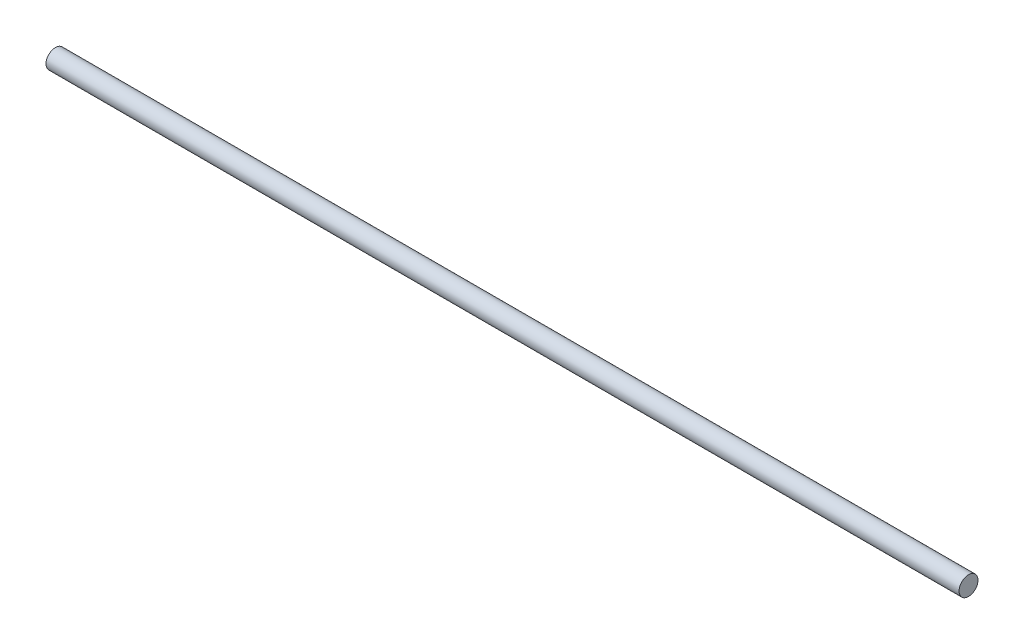
ISO-10303-21;
HEADER;
FILE_DESCRIPTION(('STEP AP214'),'2;1');
FILE_NAME('part.step','',(''),(''),'','','');
FILE_SCHEMA(('AUTOMOTIVE_DESIGN { 1 0 10303 214 1 1 1 1 }'));
ENDSEC;
DATA;
#1=APPLICATION_CONTEXT('core data for automotive mechanical design processes');
#2=APPLICATION_PROTOCOL_DEFINITION('international standard','automotive_design',2000,#1);
#3=PRODUCT_CONTEXT('',#1,'mechanical');
#4=PRODUCT('Part','Part','',(#3));
#5=PRODUCT_RELATED_PRODUCT_CATEGORY('part','',(#4));
#6=PRODUCT_DEFINITION_FORMATION('','',#4);
#7=PRODUCT_DEFINITION_CONTEXT('part definition',#1,'design');
#8=PRODUCT_DEFINITION('design','',#6,#7);
#9=PRODUCT_DEFINITION_SHAPE('','',#8);
#10=(LENGTH_UNIT() NAMED_UNIT(*) SI_UNIT(.MILLI.,.METRE.));
#11=(NAMED_UNIT(*) PLANE_ANGLE_UNIT() SI_UNIT($,.RADIAN.));
#12=(NAMED_UNIT(*) SI_UNIT($,.STERADIAN.) SOLID_ANGLE_UNIT());
#13=UNCERTAINTY_MEASURE_WITH_UNIT(LENGTH_MEASURE(1.E-05),#10,'distance_accuracy_value','');
#14=(GEOMETRIC_REPRESENTATION_CONTEXT(3) GLOBAL_UNCERTAINTY_ASSIGNED_CONTEXT((#13)) GLOBAL_UNIT_ASSIGNED_CONTEXT((#10,
#11,#12)) REPRESENTATION_CONTEXT('',''));
#15=CARTESIAN_POINT('',(0.,0.,0.));
#16=DIRECTION('',(0.,0.,1.));
#17=DIRECTION('',(1.,0.,0.));
#18=AXIS2_PLACEMENT_3D('',#15,#16,#17);
#19=CARTESIAN_POINT('',(306.3875,0.,0.));
#20=DIRECTION('',(-1.,0.,0.));
#21=DIRECTION('',(0.,0.,1.));
#22=AXIS2_PLACEMENT_3D('',#19,#20,#21);
#23=CYLINDRICAL_SURFACE('',#22,6.35);
#24=CARTESIAN_POINT('',(306.3875,0.,0.));
#25=DIRECTION('',(1.,0.,0.));
#26=DIRECTION('',(0.,0.,-1.));
#27=AXIS2_PLACEMENT_3D('',#24,#25,#26);
#28=CIRCLE('',#27,6.35);
#29=CARTESIAN_POINT('',(306.3875,0.,-6.35));
#30=VERTEX_POINT('',#29);
#31=EDGE_CURVE('E10',#30,#30,#28,.T.);
#32=ORIENTED_EDGE('',*,*,#31,.F.);
#33=EDGE_LOOP('',(#32));
#34=FACE_BOUND('',#33,.T.);
#35=CARTESIAN_POINT('',(-306.3875,0.,0.));
#36=DIRECTION('',(1.,0.,0.));
#37=DIRECTION('',(0.,0.,-1.));
#38=AXIS2_PLACEMENT_3D('',#35,#36,#37);
#39=CIRCLE('',#38,6.35);
#40=CARTESIAN_POINT('',(-306.3875,0.,-6.35));
#41=VERTEX_POINT('',#40);
#42=EDGE_CURVE('E34',#41,#41,#39,.T.);
#43=ORIENTED_EDGE('',*,*,#42,.T.);
#44=EDGE_LOOP('',(#43));
#45=FACE_BOUND('',#44,.T.);
#46=ADVANCED_FACE('F31',(#34,#45),#23,.T.);
#47=CARTESIAN_POINT('',(306.3875,0.,0.));
#48=DIRECTION('',(1.,0.,0.));
#49=DIRECTION('',(0.,0.,-1.));
#50=AXIS2_PLACEMENT_3D('',#47,#48,#49);
#51=PLANE('',#50);
#52=ORIENTED_EDGE('',*,*,#31,.T.);
#53=EDGE_LOOP('',(#52));
#54=FACE_BOUND('',#53,.T.);
#55=ADVANCED_FACE('F46',(#54),#51,.T.);
#56=CARTESIAN_POINT('',(-306.3875,0.,0.));
#57=DIRECTION('',(1.,0.,0.));
#58=DIRECTION('',(0.,0.,-1.));
#59=AXIS2_PLACEMENT_3D('',#56,#57,#58);
#60=PLANE('',#59);
#61=ORIENTED_EDGE('',*,*,#42,.F.);
#62=EDGE_LOOP('',(#61));
#63=FACE_BOUND('',#62,.T.);
#64=ADVANCED_FACE('F44',(#63),#60,.F.);
#65=CLOSED_SHELL('',(#46,#55,#64));
#66=MANIFOLD_SOLID_BREP('B2',#65);
#67=ADVANCED_BREP_SHAPE_REPRESENTATION('',(#18,#66),#14);
#68=SHAPE_DEFINITION_REPRESENTATION(#9,#67);
ENDSEC;
END-ISO-10303-21;
